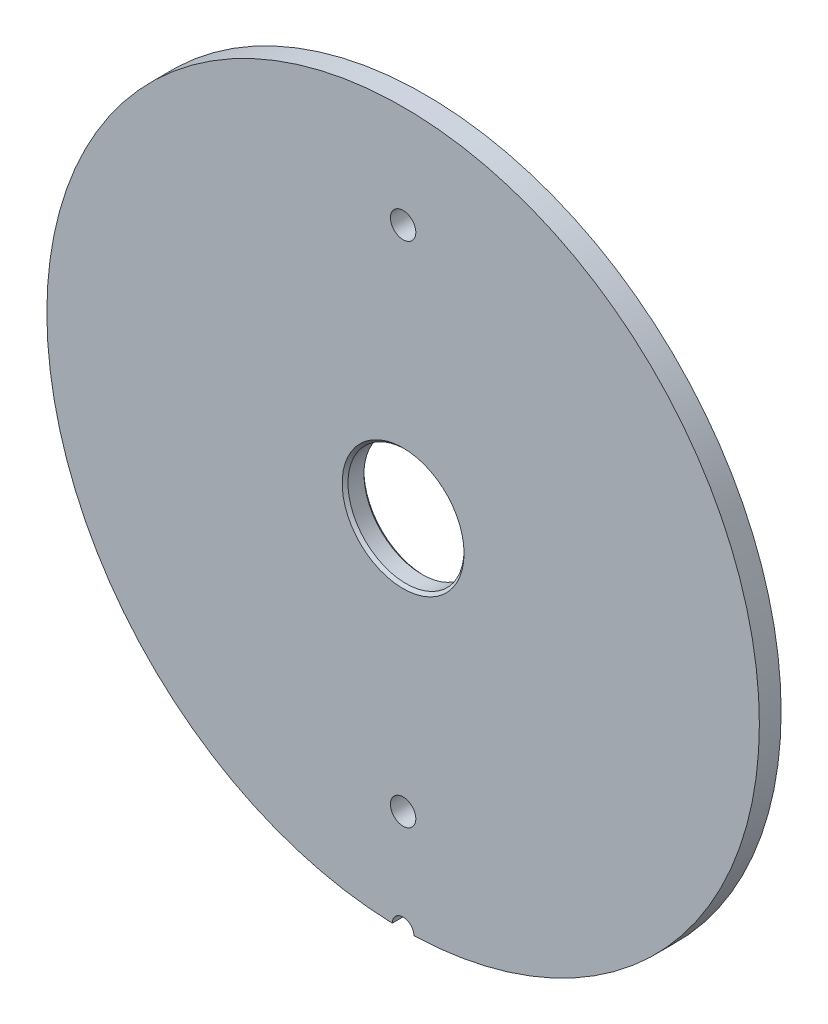
ISO-10303-21;
HEADER;
FILE_DESCRIPTION(('STEP AP214'),'2;1');
FILE_NAME('part.step','',(''),(''),'','','');
FILE_SCHEMA(('AUTOMOTIVE_DESIGN { 1 0 10303 214 1 1 1 1 }'));
ENDSEC;
DATA;
#1=APPLICATION_CONTEXT('core data for automotive mechanical design processes');
#2=APPLICATION_PROTOCOL_DEFINITION('international standard','automotive_design',2000,#1);
#3=PRODUCT_CONTEXT('',#1,'mechanical');
#4=PRODUCT('Part','Part','',(#3));
#5=PRODUCT_RELATED_PRODUCT_CATEGORY('part','',(#4));
#6=PRODUCT_DEFINITION_FORMATION('','',#4);
#7=PRODUCT_DEFINITION_CONTEXT('part definition',#1,'design');
#8=PRODUCT_DEFINITION('design','',#6,#7);
#9=PRODUCT_DEFINITION_SHAPE('','',#8);
#10=(LENGTH_UNIT() NAMED_UNIT(*) SI_UNIT(.MILLI.,.METRE.));
#11=(NAMED_UNIT(*) PLANE_ANGLE_UNIT() SI_UNIT($,.RADIAN.));
#12=(NAMED_UNIT(*) SI_UNIT($,.STERADIAN.) SOLID_ANGLE_UNIT());
#13=UNCERTAINTY_MEASURE_WITH_UNIT(LENGTH_MEASURE(1.E-05),#10,'distance_accuracy_value','');
#14=(GEOMETRIC_REPRESENTATION_CONTEXT(3) GLOBAL_UNCERTAINTY_ASSIGNED_CONTEXT((#13)) GLOBAL_UNIT_ASSIGNED_CONTEXT((#10,
#11,#12)) REPRESENTATION_CONTEXT('',''));
#15=CARTESIAN_POINT('',(0.,0.,0.));
#16=DIRECTION('',(0.,0.,1.));
#17=DIRECTION('',(1.,0.,0.));
#18=AXIS2_PLACEMENT_3D('',#15,#16,#17);
#19=CARTESIAN_POINT('',(0.,0.,15.));
#20=DIRECTION('',(0.,0.,1.));
#21=DIRECTION('',(1.,0.,0.));
#22=AXIS2_PLACEMENT_3D('',#19,#20,#21);
#23=PLANE('',#22);
#24=CARTESIAN_POINT('',(0.,-245.5,15.));
#25=DIRECTION('',(0.,0.,1.));
#26=DIRECTION('',(1.,0.,0.));
#27=AXIS2_PLACEMENT_3D('',#24,#25,#26);
#28=CIRCLE('',#27,7.5);
#29=CARTESIAN_POINT('',(-7.49912498369576,-245.385437881874,15.));
#30=VERTEX_POINT('',#29);
#31=CARTESIAN_POINT('',(7.49912498369559,-245.385437881874,15.));
#32=VERTEX_POINT('',#31);
#33=EDGE_CURVE('E75',#30,#32,#28,.F.);
#34=ORIENTED_EDGE('',*,*,#33,.T.);
#35=CARTESIAN_POINT('',(0.,0.,15.));
#36=DIRECTION('',(0.,0.,1.));
#37=DIRECTION('',(1.,0.,0.));
#38=AXIS2_PLACEMENT_3D('',#35,#36,#37);
#39=CIRCLE('',#38,245.5);
#40=EDGE_CURVE('E87',#32,#30,#39,.T.);
#41=ORIENTED_EDGE('',*,*,#40,.T.);
#42=EDGE_LOOP('',(#34,#41));
#43=FACE_BOUND('',#42,.T.);
#44=CARTESIAN_POINT('',(0.,0.,15.));
#45=DIRECTION('',(0.,0.,1.));
#46=DIRECTION('',(1.,0.,0.));
#47=AXIS2_PLACEMENT_3D('',#44,#45,#46);
#48=CIRCLE('',#47,42.0000000000001);
#49=CARTESIAN_POINT('',(42.0000000000001,0.,15.));
#50=VERTEX_POINT('',#49);
#51=EDGE_CURVE('E13',#50,#50,#48,.F.);
#52=ORIENTED_EDGE('',*,*,#51,.T.);
#53=EDGE_LOOP('',(#52));
#54=FACE_BOUND('',#53,.T.);
#55=CARTESIAN_POINT('',(0.,175.,15.));
#56=DIRECTION('',(0.,0.,1.));
#57=DIRECTION('',(1.,0.,0.));
#58=AXIS2_PLACEMENT_3D('',#55,#56,#57);
#59=CIRCLE('',#58,8.75);
#60=CARTESIAN_POINT('',(8.75,175.,15.));
#61=VERTEX_POINT('',#60);
#62=EDGE_CURVE('E129',#61,#61,#59,.T.);
#63=ORIENTED_EDGE('',*,*,#62,.F.);
#64=EDGE_LOOP('',(#63));
#65=FACE_BOUND('',#64,.T.);
#66=CARTESIAN_POINT('',(0.,-175.,15.));
#67=DIRECTION('',(0.,0.,1.));
#68=DIRECTION('',(1.,0.,0.));
#69=AXIS2_PLACEMENT_3D('',#66,#67,#68);
#70=CIRCLE('',#69,8.75);
#71=CARTESIAN_POINT('',(8.75,-175.,15.));
#72=VERTEX_POINT('',#71);
#73=EDGE_CURVE('E93',#72,#72,#70,.T.);
#74=ORIENTED_EDGE('',*,*,#73,.F.);
#75=EDGE_LOOP('',(#74));
#76=FACE_BOUND('',#75,.T.);
#77=ADVANCED_FACE('F48',(#43,#54,#65,#76),#23,.T.);
#78=CARTESIAN_POINT('',(0.,0.,0.));
#79=DIRECTION('',(0.,0.,1.));
#80=DIRECTION('',(1.,0.,0.));
#81=AXIS2_PLACEMENT_3D('',#78,#79,#80);
#82=PLANE('',#81);
#83=CARTESIAN_POINT('',(0.,0.,0.));
#84=DIRECTION('',(0.,0.,1.));
#85=DIRECTION('',(1.,0.,0.));
#86=AXIS2_PLACEMENT_3D('',#83,#84,#85);
#87=CIRCLE('',#86,42.);
#88=CARTESIAN_POINT('',(42.,0.,0.));
#89=VERTEX_POINT('',#88);
#90=EDGE_CURVE('E90',#89,#89,#87,.T.);
#91=ORIENTED_EDGE('',*,*,#90,.T.);
#92=EDGE_LOOP('',(#91));
#93=FACE_BOUND('',#92,.T.);
#94=CARTESIAN_POINT('',(0.,175.,0.));
#95=DIRECTION('',(0.,0.,1.));
#96=DIRECTION('',(1.,0.,0.));
#97=AXIS2_PLACEMENT_3D('',#94,#95,#96);
#98=CIRCLE('',#97,8.75);
#99=CARTESIAN_POINT('',(8.75,175.,0.));
#100=VERTEX_POINT('',#99);
#101=EDGE_CURVE('E118',#100,#100,#98,.T.);
#102=ORIENTED_EDGE('',*,*,#101,.T.);
#103=EDGE_LOOP('',(#102));
#104=FACE_BOUND('',#103,.T.);
#105=CARTESIAN_POINT('',(0.,-175.,0.));
#106=DIRECTION('',(0.,0.,1.));
#107=DIRECTION('',(1.,0.,0.));
#108=AXIS2_PLACEMENT_3D('',#105,#106,#107);
#109=CIRCLE('',#108,8.75);
#110=CARTESIAN_POINT('',(8.75,-175.,0.));
#111=VERTEX_POINT('',#110);
#112=EDGE_CURVE('E88',#111,#111,#109,.T.);
#113=ORIENTED_EDGE('',*,*,#112,.T.);
#114=EDGE_LOOP('',(#113));
#115=FACE_BOUND('',#114,.T.);
#116=CARTESIAN_POINT('',(0.,0.,0.));
#117=DIRECTION('',(0.,0.,1.));
#118=DIRECTION('',(1.,0.,0.));
#119=AXIS2_PLACEMENT_3D('',#116,#117,#118);
#120=CIRCLE('',#119,245.5);
#121=CARTESIAN_POINT('',(7.49912498369579,-245.385437881874,0.));
#122=VERTEX_POINT('',#121);
#123=CARTESIAN_POINT('',(-7.49912498369579,-245.385437881874,0.));
#124=VERTEX_POINT('',#123);
#125=EDGE_CURVE('E84',#122,#124,#120,.T.);
#126=ORIENTED_EDGE('',*,*,#125,.F.);
#127=CARTESIAN_POINT('',(0.,-245.5,0.));
#128=DIRECTION('',(0.,0.,-1.));
#129=DIRECTION('',(-1.,0.,0.));
#130=AXIS2_PLACEMENT_3D('',#127,#128,#129);
#131=CIRCLE('',#130,7.5);
#132=EDGE_CURVE('E63',#124,#122,#131,.T.);
#133=ORIENTED_EDGE('',*,*,#132,.F.);
#134=EDGE_LOOP('',(#126,#133));
#135=FACE_BOUND('',#134,.T.);
#136=ADVANCED_FACE('F83',(#93,#104,#115,#135),#82,.F.);
#137=CARTESIAN_POINT('',(0.,0.,15.));
#138=DIRECTION('',(0.,0.,-1.));
#139=DIRECTION('',(-1.,0.,0.));
#140=AXIS2_PLACEMENT_3D('',#137,#138,#139);
#141=CYLINDRICAL_SURFACE('',#140,245.5);
#142=ORIENTED_EDGE('',*,*,#125,.T.);
#143=DIRECTION('',(0.,0.,-1.));
#144=VECTOR('',#143,1.);
#145=CARTESIAN_POINT('',(-7.49912498369579,-245.385437881874,7.5));
#146=LINE('',#145,#144);
#147=EDGE_CURVE('E73',#30,#124,#146,.T.);
#148=ORIENTED_EDGE('',*,*,#147,.F.);
#149=ORIENTED_EDGE('',*,*,#40,.F.);
#150=DIRECTION('',(0.,0.,-1.));
#151=VECTOR('',#150,1.);
#152=CARTESIAN_POINT('',(7.49912498369579,-245.385437881874,7.5));
#153=LINE('',#152,#151);
#154=EDGE_CURVE('E67',#122,#32,#153,.F.);
#155=ORIENTED_EDGE('',*,*,#154,.F.);
#156=EDGE_LOOP('',(#142,#148,#149,#155));
#157=FACE_BOUND('',#156,.T.);
#158=ADVANCED_FACE('F86',(#157),#141,.T.);
#159=CARTESIAN_POINT('',(0.,0.,15.));
#160=DIRECTION('',(0.,0.,-1.));
#161=DIRECTION('',(-1.,0.,0.));
#162=AXIS2_PLACEMENT_3D('',#159,#160,#161);
#163=CYLINDRICAL_SURFACE('',#162,40.);
#164=CARTESIAN_POINT('',(0.,0.,2.00000000000001));
#165=DIRECTION('',(0.,0.,1.));
#166=DIRECTION('',(1.,0.,0.));
#167=AXIS2_PLACEMENT_3D('',#164,#165,#166);
#168=CIRCLE('',#167,40.);
#169=CARTESIAN_POINT('',(40.,0.,2.00000000000001));
#170=VERTEX_POINT('',#169);
#171=EDGE_CURVE('E56',#170,#170,#168,.F.);
#172=ORIENTED_EDGE('',*,*,#171,.T.);
#173=EDGE_LOOP('',(#172));
#174=FACE_BOUND('',#173,.T.);
#175=CARTESIAN_POINT('',(0.,0.,12.9999999999999));
#176=DIRECTION('',(0.,0.,1.));
#177=DIRECTION('',(1.,0.,0.));
#178=AXIS2_PLACEMENT_3D('',#175,#176,#177);
#179=CIRCLE('',#178,40.);
#180=CARTESIAN_POINT('',(40.,0.,12.9999999999999));
#181=VERTEX_POINT('',#180);
#182=EDGE_CURVE('E98',#181,#181,#179,.T.);
#183=ORIENTED_EDGE('',*,*,#182,.T.);
#184=EDGE_LOOP('',(#183));
#185=FACE_BOUND('',#184,.T.);
#186=ADVANCED_FACE('F103',(#174,#185),#163,.F.);
#187=CARTESIAN_POINT('',(0.,-175.,15.));
#188=DIRECTION('',(0.,0.,1.));
#189=DIRECTION('',(1.,0.,0.));
#190=AXIS2_PLACEMENT_3D('',#187,#188,#189);
#191=CYLINDRICAL_SURFACE('',#190,8.75);
#192=ORIENTED_EDGE('',*,*,#112,.F.);
#193=EDGE_LOOP('',(#192));
#194=FACE_BOUND('',#193,.T.);
#195=ORIENTED_EDGE('',*,*,#73,.T.);
#196=EDGE_LOOP('',(#195));
#197=FACE_BOUND('',#196,.T.);
#198=ADVANCED_FACE('F121',(#194,#197),#191,.F.);
#199=CARTESIAN_POINT('',(0.,175.,15.));
#200=DIRECTION('',(0.,0.,1.));
#201=DIRECTION('',(1.,0.,0.));
#202=AXIS2_PLACEMENT_3D('',#199,#200,#201);
#203=CYLINDRICAL_SURFACE('',#202,8.75);
#204=ORIENTED_EDGE('',*,*,#101,.F.);
#205=EDGE_LOOP('',(#204));
#206=FACE_BOUND('',#205,.T.);
#207=ORIENTED_EDGE('',*,*,#62,.T.);
#208=EDGE_LOOP('',(#207));
#209=FACE_BOUND('',#208,.T.);
#210=ADVANCED_FACE('F109',(#206,#209),#203,.F.);
#211=CARTESIAN_POINT('',(0.,0.,0.));
#212=DIRECTION('',(0.,0.,-1.));
#213=DIRECTION('',(-1.,0.,0.));
#214=AXIS2_PLACEMENT_3D('',#211,#212,#213);
#215=CONICAL_SURFACE('',#214,42.,0.785398163397455);
#216=ORIENTED_EDGE('',*,*,#171,.F.);
#217=EDGE_LOOP('',(#216));
#218=FACE_BOUND('',#217,.T.);
#219=ORIENTED_EDGE('',*,*,#90,.F.);
#220=EDGE_LOOP('',(#219));
#221=FACE_BOUND('',#220,.T.);
#222=ADVANCED_FACE('F106',(#218,#221),#215,.F.);
#223=CARTESIAN_POINT('',(0.,0.,12.9999999999999));
#224=DIRECTION('',(0.,0.,1.));
#225=DIRECTION('',(1.,0.,0.));
#226=AXIS2_PLACEMENT_3D('',#223,#224,#225);
#227=CONICAL_SURFACE('',#226,40.,0.785398163397455);
#228=ORIENTED_EDGE('',*,*,#51,.F.);
#229=EDGE_LOOP('',(#228));
#230=FACE_BOUND('',#229,.T.);
#231=ORIENTED_EDGE('',*,*,#182,.F.);
#232=EDGE_LOOP('',(#231));
#233=FACE_BOUND('',#232,.T.);
#234=ADVANCED_FACE('F50',(#230,#233),#227,.F.);
#235=CARTESIAN_POINT('',(0.,-245.5,15.001));
#236=DIRECTION('',(0.,0.,-1.));
#237=DIRECTION('',(-1.,0.,0.));
#238=AXIS2_PLACEMENT_3D('',#235,#236,#237);
#239=CYLINDRICAL_SURFACE('',#238,7.5);
#240=ORIENTED_EDGE('',*,*,#154,.T.);
#241=ORIENTED_EDGE('',*,*,#33,.F.);
#242=ORIENTED_EDGE('',*,*,#147,.T.);
#243=ORIENTED_EDGE('',*,*,#132,.T.);
#244=EDGE_LOOP('',(#240,#241,#242,#243));
#245=FACE_BOUND('',#244,.T.);
#246=ADVANCED_FACE('F74',(#245),#239,.F.);
#247=CLOSED_SHELL('',(#77,#136,#158,#186,#198,#210,#222,#234,#246));
#248=MANIFOLD_SOLID_BREP('B2',#247);
#249=ADVANCED_BREP_SHAPE_REPRESENTATION('',(#18,#248),#14);
#250=SHAPE_DEFINITION_REPRESENTATION(#9,#249);
ENDSEC;
END-ISO-10303-21;
